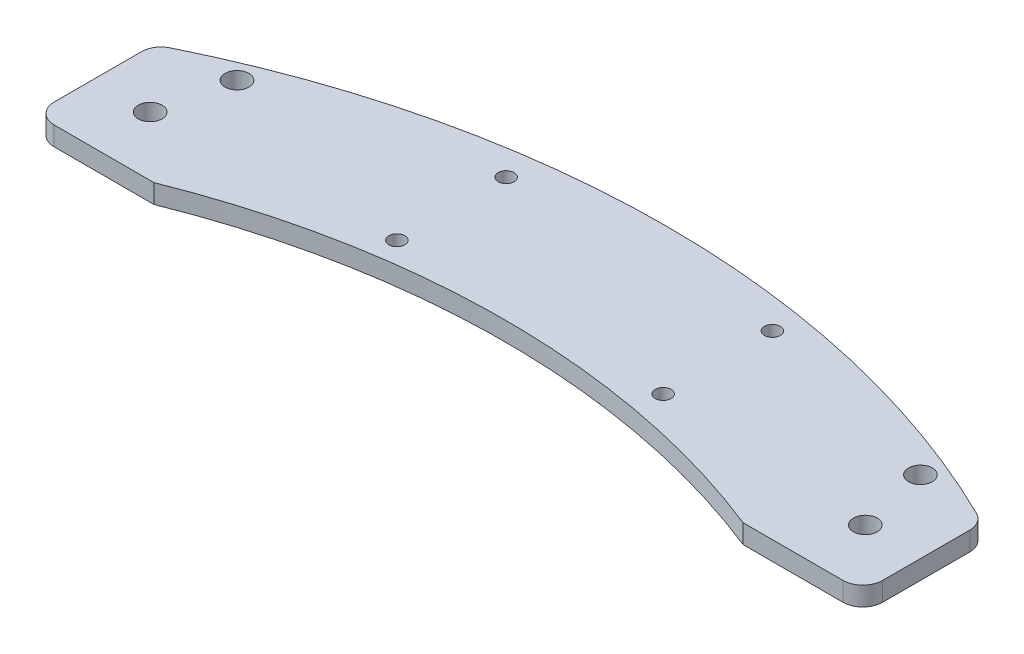
ISO-10303-21;
HEADER;
FILE_DESCRIPTION(('STEP AP214'),'2;1');
FILE_NAME('part.step','',(''),(''),'','','');
FILE_SCHEMA(('AUTOMOTIVE_DESIGN { 1 0 10303 214 1 1 1 1 }'));
ENDSEC;
DATA;
#1=APPLICATION_CONTEXT('core data for automotive mechanical design processes');
#2=APPLICATION_PROTOCOL_DEFINITION('international standard','automotive_design',2000,#1);
#3=PRODUCT_CONTEXT('',#1,'mechanical');
#4=PRODUCT('Part','Part','',(#3));
#5=PRODUCT_RELATED_PRODUCT_CATEGORY('part','',(#4));
#6=PRODUCT_DEFINITION_FORMATION('','',#4);
#7=PRODUCT_DEFINITION_CONTEXT('part definition',#1,'design');
#8=PRODUCT_DEFINITION('design','',#6,#7);
#9=PRODUCT_DEFINITION_SHAPE('','',#8);
#10=(LENGTH_UNIT() NAMED_UNIT(*) SI_UNIT(.MILLI.,.METRE.));
#11=(NAMED_UNIT(*) PLANE_ANGLE_UNIT() SI_UNIT($,.RADIAN.));
#12=(NAMED_UNIT(*) SI_UNIT($,.STERADIAN.) SOLID_ANGLE_UNIT());
#13=UNCERTAINTY_MEASURE_WITH_UNIT(LENGTH_MEASURE(1.E-05),#10,'distance_accuracy_value','');
#14=(GEOMETRIC_REPRESENTATION_CONTEXT(3) GLOBAL_UNCERTAINTY_ASSIGNED_CONTEXT((#13)) GLOBAL_UNIT_ASSIGNED_CONTEXT((#10,
#11,#12)) REPRESENTATION_CONTEXT('',''));
#15=CARTESIAN_POINT('',(0.,0.,0.));
#16=DIRECTION('',(0.,0.,1.));
#17=DIRECTION('',(1.,0.,0.));
#18=AXIS2_PLACEMENT_3D('',#15,#16,#17);
#19=CARTESIAN_POINT('',(0.,4.7752,0.));
#20=DIRECTION('',(0.,1.,0.));
#21=DIRECTION('',(0.,0.,1.));
#22=AXIS2_PLACEMENT_3D('',#19,#20,#21);
#23=PLANE('',#22);
#24=CARTESIAN_POINT('',(117.643252286146,4.7752,-0.323685487016556));
#25=DIRECTION('',(0.,1.,0.));
#26=DIRECTION('',(0.,0.,1.));
#27=AXIS2_PLACEMENT_3D('',#24,#25,#26);
#28=CIRCLE('',#27,3.00000000000001);
#29=CARTESIAN_POINT('',(117.643252286146,4.7752,2.67631451298345));
#30=VERTEX_POINT('',#29);
#31=EDGE_CURVE('E212',#30,#30,#28,.T.);
#32=ORIENTED_EDGE('',*,*,#31,.F.);
#33=EDGE_LOOP('',(#32));
#34=FACE_BOUND('',#33,.T.);
#35=CARTESIAN_POINT('',(0.643252286145771,4.7752,14.4263145129834));
#36=DIRECTION('',(0.,1.,0.));
#37=DIRECTION('',(0.,0.,1.));
#38=AXIS2_PLACEMENT_3D('',#35,#36,#37);
#39=CIRCLE('',#38,2.);
#40=CARTESIAN_POINT('',(0.643252286145771,4.7752,16.4263145129834));
#41=VERTEX_POINT('',#40);
#42=EDGE_CURVE('E224',#41,#41,#39,.T.);
#43=ORIENTED_EDGE('',*,*,#42,.F.);
#44=EDGE_LOOP('',(#43));
#45=FACE_BOUND('',#44,.T.);
#46=CARTESIAN_POINT('',(-54.3567477138542,4.7752,-0.323685487016556));
#47=DIRECTION('',(0.,1.,0.));
#48=DIRECTION('',(0.,0.,1.));
#49=AXIS2_PLACEMENT_3D('',#46,#47,#48);
#50=CIRCLE('',#49,3.);
#51=CARTESIAN_POINT('',(-54.3567477138542,4.7752,2.67631451298345));
#52=VERTEX_POINT('',#51);
#53=EDGE_CURVE('E236',#52,#52,#50,.T.);
#54=ORIENTED_EDGE('',*,*,#53,.F.);
#55=EDGE_LOOP('',(#54));
#56=FACE_BOUND('',#55,.T.);
#57=CARTESIAN_POINT('',(121.643252286146,4.7752,17.5263145129834));
#58=DIRECTION('',(0.,1.,0.));
#59=DIRECTION('',(0.,0.,1.));
#60=AXIS2_PLACEMENT_3D('',#57,#58,#59);
#61=CIRCLE('',#60,3.00000000000001);
#62=CARTESIAN_POINT('',(121.643252286146,4.7752,20.5263145129835));
#63=VERTEX_POINT('',#62);
#64=EDGE_CURVE('E148',#63,#63,#61,.T.);
#65=ORIENTED_EDGE('',*,*,#64,.F.);
#66=EDGE_LOOP('',(#65));
#67=FACE_BOUND('',#66,.T.);
#68=CARTESIAN_POINT('',(-58.3567477138542,4.7752,17.5263145129834));
#69=DIRECTION('',(0.,1.,0.));
#70=DIRECTION('',(0.,0.,1.));
#71=AXIS2_PLACEMENT_3D('',#68,#69,#70);
#72=CIRCLE('',#71,3.);
#73=CARTESIAN_POINT('',(-58.3567477138542,4.7752,20.5263145129834));
#74=VERTEX_POINT('',#73);
#75=EDGE_CURVE('E242',#74,#74,#72,.T.);
#76=ORIENTED_EDGE('',*,*,#75,.F.);
#77=EDGE_LOOP('',(#76));
#78=FACE_BOUND('',#77,.T.);
#79=CARTESIAN_POINT('',(67.6432522861458,4.7752,-13.0736854870166));
#80=DIRECTION('',(0.,1.,0.));
#81=DIRECTION('',(0.,0.,1.));
#82=AXIS2_PLACEMENT_3D('',#79,#80,#81);
#83=CIRCLE('',#82,2.);
#84=CARTESIAN_POINT('',(67.6432522861458,4.7752,-11.0736854870166));
#85=VERTEX_POINT('',#84);
#86=EDGE_CURVE('E230',#85,#85,#83,.T.);
#87=ORIENTED_EDGE('',*,*,#86,.F.);
#88=EDGE_LOOP('',(#87));
#89=FACE_BOUND('',#88,.T.);
#90=CARTESIAN_POINT('',(67.6432522861458,4.7752,14.4263145129834));
#91=DIRECTION('',(0.,1.,0.));
#92=DIRECTION('',(0.,0.,1.));
#93=AXIS2_PLACEMENT_3D('',#90,#91,#92);
#94=CIRCLE('',#93,2.);
#95=CARTESIAN_POINT('',(67.6432522861458,4.7752,16.4263145129834));
#96=VERTEX_POINT('',#95);
#97=EDGE_CURVE('E218',#96,#96,#94,.T.);
#98=ORIENTED_EDGE('',*,*,#97,.F.);
#99=EDGE_LOOP('',(#98));
#100=FACE_BOUND('',#99,.T.);
#101=CARTESIAN_POINT('',(0.643252286145771,4.7752,-13.0736854870166));
#102=DIRECTION('',(0.,1.,0.));
#103=DIRECTION('',(0.,0.,1.));
#104=AXIS2_PLACEMENT_3D('',#101,#102,#103);
#105=CIRCLE('',#104,2.);
#106=CARTESIAN_POINT('',(0.643252286145771,4.7752,-11.0736854870166));
#107=VERTEX_POINT('',#106);
#108=EDGE_CURVE('E206',#107,#107,#105,.T.);
#109=ORIENTED_EDGE('',*,*,#108,.F.);
#110=EDGE_LOOP('',(#109));
#111=FACE_BOUND('',#110,.T.);
#112=DIRECTION('',(1.,0.,0.));
#113=VECTOR('',#112,1.);
#114=CARTESIAN_POINT('',(-72.6067477138542,4.7752,32.4263145129834));
#115=LINE('',#114,#113);
#116=CARTESIAN_POINT('',(105.784586911306,4.7752,32.4263145129834));
#117=VERTEX_POINT('',#116);
#118=CARTESIAN_POINT('',(130.893252286146,4.7752,32.4263145129834));
#119=VERTEX_POINT('',#118);
#120=EDGE_CURVE('E129',#117,#119,#115,.T.);
#121=ORIENTED_EDGE('',*,*,#120,.T.);
#122=CARTESIAN_POINT('',(130.893252286146,4.7752,27.4263145129834));
#123=DIRECTION('',(0.,1.,0.));
#124=DIRECTION('',(0.,0.,1.));
#125=AXIS2_PLACEMENT_3D('',#122,#123,#124);
#126=CIRCLE('',#125,5.);
#127=CARTESIAN_POINT('',(135.893252286146,4.7752,27.4263145129834));
#128=VERTEX_POINT('',#127);
#129=EDGE_CURVE('E173',#119,#128,#126,.T.);
#130=ORIENTED_EDGE('',*,*,#129,.T.);
#131=DIRECTION('',(0.,0.,-1.));
#132=VECTOR('',#131,1.);
#133=CARTESIAN_POINT('',(135.893252286146,4.7752,-22.5736854870166));
#134=LINE('',#133,#132);
#135=CARTESIAN_POINT('',(135.893252286146,4.7752,5.49950227647036));
#136=VERTEX_POINT('',#135);
#137=EDGE_CURVE('E126',#128,#136,#134,.T.);
#138=ORIENTED_EDGE('',*,*,#137,.T.);
#139=CARTESIAN_POINT('',(130.893252286146,4.7752,5.49950227647036));
#140=DIRECTION('',(0.,1.,0.));
#141=DIRECTION('',(0.,0.,1.));
#142=AXIS2_PLACEMENT_3D('',#139,#140,#141);
#143=CIRCLE('',#142,5.);
#144=CARTESIAN_POINT('',(133.098807841701,4.7752,1.01223978232562));
#145=VERTEX_POINT('',#144);
#146=EDGE_CURVE('E171',#136,#145,#143,.T.);
#147=ORIENTED_EDGE('',*,*,#146,.T.);
#148=CARTESIAN_POINT('',(31.6432522861458,4.7752,207.426314512983));
#149=DIRECTION('',(0.,1.,0.));
#150=DIRECTION('',(0.,0.,1.));
#151=AXIS2_PLACEMENT_3D('',#148,#149,#150);
#152=CIRCLE('',#151,230.);
#153=CARTESIAN_POINT('',(-69.8123032694098,4.7752,1.01223978232565));
#154=VERTEX_POINT('',#153);
#155=EDGE_CURVE('E198',#145,#154,#152,.T.);
#156=ORIENTED_EDGE('',*,*,#155,.T.);
#157=CARTESIAN_POINT('',(-67.6067477138542,4.7752,5.49950227647036));
#158=DIRECTION('',(0.,1.,0.));
#159=DIRECTION('',(0.,0.,1.));
#160=AXIS2_PLACEMENT_3D('',#157,#158,#159);
#161=CIRCLE('',#160,5.);
#162=CARTESIAN_POINT('',(-72.6067477138542,4.7752,5.49950227647036));
#163=VERTEX_POINT('',#162);
#164=EDGE_CURVE('E169',#154,#163,#161,.T.);
#165=ORIENTED_EDGE('',*,*,#164,.T.);
#166=DIRECTION('',(0.,0.,1.));
#167=VECTOR('',#166,1.);
#168=CARTESIAN_POINT('',(-72.6067477138542,4.7752,-22.5736854870166));
#169=LINE('',#168,#167);
#170=CARTESIAN_POINT('',(-72.6067477138542,4.7752,27.4263145129834));
#171=VERTEX_POINT('',#170);
#172=EDGE_CURVE('E137',#163,#171,#169,.T.);
#173=ORIENTED_EDGE('',*,*,#172,.T.);
#174=CARTESIAN_POINT('',(-67.6067477138542,4.7752,27.4263145129834));
#175=DIRECTION('',(0.,1.,0.));
#176=DIRECTION('',(0.,0.,1.));
#177=AXIS2_PLACEMENT_3D('',#174,#175,#176);
#178=CIRCLE('',#177,5.);
#179=CARTESIAN_POINT('',(-67.6067477138542,4.7752,32.4263145129834));
#180=VERTEX_POINT('',#179);
#181=EDGE_CURVE('E49',#171,#180,#178,.T.);
#182=ORIENTED_EDGE('',*,*,#181,.T.);
#183=CARTESIAN_POINT('',(-42.4980823390147,4.7752,32.4263145129834));
#184=VERTEX_POINT('',#183);
#185=EDGE_CURVE('E131',#180,#184,#115,.T.);
#186=ORIENTED_EDGE('',*,*,#185,.T.);
#187=CARTESIAN_POINT('',(31.6432522861458,4.7752,218.176314512983));
#188=DIRECTION('',(0.,1.,0.));
#189=DIRECTION('',(0.,0.,1.));
#190=AXIS2_PLACEMENT_3D('',#187,#188,#189);
#191=CIRCLE('',#190,200.);
#192=EDGE_CURVE('E117',#117,#184,#191,.T.);
#193=ORIENTED_EDGE('',*,*,#192,.F.);
#194=EDGE_LOOP('',(#121,#130,#138,#147,#156,#165,#173,#182,#186,#193));
#195=FACE_BOUND('',#194,.T.);
#196=ADVANCED_FACE('F34',(#34,#45,#56,#67,#78,#89,#100,#111,#195),#23,.T.);
#197=CARTESIAN_POINT('',(0.,0.,0.));
#198=DIRECTION('',(0.,1.,0.));
#199=DIRECTION('',(0.,0.,1.));
#200=AXIS2_PLACEMENT_3D('',#197,#198,#199);
#201=PLANE('',#200);
#202=CARTESIAN_POINT('',(117.643252286146,0.,-0.323685487016556));
#203=DIRECTION('',(0.,1.,0.));
#204=DIRECTION('',(0.,0.,1.));
#205=AXIS2_PLACEMENT_3D('',#202,#203,#204);
#206=CIRCLE('',#205,3.00000000000001);
#207=CARTESIAN_POINT('',(117.643252286146,0.,2.67631451298345));
#208=VERTEX_POINT('',#207);
#209=EDGE_CURVE('E209',#208,#208,#206,.T.);
#210=ORIENTED_EDGE('',*,*,#209,.T.);
#211=EDGE_LOOP('',(#210));
#212=FACE_BOUND('',#211,.T.);
#213=CARTESIAN_POINT('',(0.643252286145771,0.,14.4263145129834));
#214=DIRECTION('',(0.,1.,0.));
#215=DIRECTION('',(0.,0.,1.));
#216=AXIS2_PLACEMENT_3D('',#213,#214,#215);
#217=CIRCLE('',#216,2.);
#218=CARTESIAN_POINT('',(0.643252286145771,0.,16.4263145129834));
#219=VERTEX_POINT('',#218);
#220=EDGE_CURVE('E221',#219,#219,#217,.T.);
#221=ORIENTED_EDGE('',*,*,#220,.T.);
#222=EDGE_LOOP('',(#221));
#223=FACE_BOUND('',#222,.T.);
#224=CARTESIAN_POINT('',(-54.3567477138542,0.,-0.323685487016556));
#225=DIRECTION('',(0.,1.,0.));
#226=DIRECTION('',(0.,0.,1.));
#227=AXIS2_PLACEMENT_3D('',#224,#225,#226);
#228=CIRCLE('',#227,3.);
#229=CARTESIAN_POINT('',(-54.3567477138542,0.,2.67631451298345));
#230=VERTEX_POINT('',#229);
#231=EDGE_CURVE('E233',#230,#230,#228,.T.);
#232=ORIENTED_EDGE('',*,*,#231,.T.);
#233=EDGE_LOOP('',(#232));
#234=FACE_BOUND('',#233,.T.);
#235=CARTESIAN_POINT('',(121.643252286146,0.,17.5263145129834));
#236=DIRECTION('',(0.,1.,0.));
#237=DIRECTION('',(0.,0.,1.));
#238=AXIS2_PLACEMENT_3D('',#235,#236,#237);
#239=CIRCLE('',#238,3.00000000000001);
#240=CARTESIAN_POINT('',(121.643252286146,0.,20.5263145129835));
#241=VERTEX_POINT('',#240);
#242=EDGE_CURVE('E245',#241,#241,#239,.T.);
#243=ORIENTED_EDGE('',*,*,#242,.T.);
#244=EDGE_LOOP('',(#243));
#245=FACE_BOUND('',#244,.T.);
#246=CARTESIAN_POINT('',(-58.3567477138542,0.,17.5263145129834));
#247=DIRECTION('',(0.,1.,0.));
#248=DIRECTION('',(0.,0.,1.));
#249=AXIS2_PLACEMENT_3D('',#246,#247,#248);
#250=CIRCLE('',#249,3.);
#251=CARTESIAN_POINT('',(-58.3567477138542,0.,20.5263145129834));
#252=VERTEX_POINT('',#251);
#253=EDGE_CURVE('E239',#252,#252,#250,.T.);
#254=ORIENTED_EDGE('',*,*,#253,.T.);
#255=EDGE_LOOP('',(#254));
#256=FACE_BOUND('',#255,.T.);
#257=CARTESIAN_POINT('',(67.6432522861458,0.,-13.0736854870166));
#258=DIRECTION('',(0.,1.,0.));
#259=DIRECTION('',(0.,0.,1.));
#260=AXIS2_PLACEMENT_3D('',#257,#258,#259);
#261=CIRCLE('',#260,2.);
#262=CARTESIAN_POINT('',(67.6432522861458,0.,-11.0736854870166));
#263=VERTEX_POINT('',#262);
#264=EDGE_CURVE('E227',#263,#263,#261,.T.);
#265=ORIENTED_EDGE('',*,*,#264,.T.);
#266=EDGE_LOOP('',(#265));
#267=FACE_BOUND('',#266,.T.);
#268=CARTESIAN_POINT('',(67.6432522861458,0.,14.4263145129834));
#269=DIRECTION('',(0.,1.,0.));
#270=DIRECTION('',(0.,0.,1.));
#271=AXIS2_PLACEMENT_3D('',#268,#269,#270);
#272=CIRCLE('',#271,2.);
#273=CARTESIAN_POINT('',(67.6432522861458,0.,16.4263145129834));
#274=VERTEX_POINT('',#273);
#275=EDGE_CURVE('E215',#274,#274,#272,.T.);
#276=ORIENTED_EDGE('',*,*,#275,.T.);
#277=EDGE_LOOP('',(#276));
#278=FACE_BOUND('',#277,.T.);
#279=CARTESIAN_POINT('',(0.643252286145771,0.,-13.0736854870166));
#280=DIRECTION('',(0.,1.,0.));
#281=DIRECTION('',(0.,0.,1.));
#282=AXIS2_PLACEMENT_3D('',#279,#280,#281);
#283=CIRCLE('',#282,2.);
#284=CARTESIAN_POINT('',(0.643252286145771,0.,-11.0736854870166));
#285=VERTEX_POINT('',#284);
#286=EDGE_CURVE('E204',#285,#285,#283,.T.);
#287=ORIENTED_EDGE('',*,*,#286,.T.);
#288=EDGE_LOOP('',(#287));
#289=FACE_BOUND('',#288,.T.);
#290=DIRECTION('',(0.,0.,-1.));
#291=VECTOR('',#290,1.);
#292=CARTESIAN_POINT('',(135.893252286146,0.,-22.5736854870166));
#293=LINE('',#292,#291);
#294=CARTESIAN_POINT('',(135.893252286146,0.,27.4263145129834));
#295=VERTEX_POINT('',#294);
#296=CARTESIAN_POINT('',(135.893252286146,0.,5.49950227647036));
#297=VERTEX_POINT('',#296);
#298=EDGE_CURVE('E139',#295,#297,#293,.T.);
#299=ORIENTED_EDGE('',*,*,#298,.F.);
#300=CARTESIAN_POINT('',(130.893252286146,0.,27.4263145129834));
#301=DIRECTION('',(0.,1.,0.));
#302=DIRECTION('',(0.,0.,1.));
#303=AXIS2_PLACEMENT_3D('',#300,#301,#302);
#304=CIRCLE('',#303,5.);
#305=CARTESIAN_POINT('',(130.893252286146,0.,32.4263145129834));
#306=VERTEX_POINT('',#305);
#307=EDGE_CURVE('E165',#295,#306,#304,.F.);
#308=ORIENTED_EDGE('',*,*,#307,.T.);
#309=DIRECTION('',(1.,0.,0.));
#310=VECTOR('',#309,1.);
#311=CARTESIAN_POINT('',(-72.6067477138542,0.,32.4263145129834));
#312=LINE('',#311,#310);
#313=CARTESIAN_POINT('',(105.784586911306,0.,32.4263145129834));
#314=VERTEX_POINT('',#313);
#315=EDGE_CURVE('E147',#314,#306,#312,.T.);
#316=ORIENTED_EDGE('',*,*,#315,.F.);
#317=CARTESIAN_POINT('',(31.6432522861458,0.,218.176314512983));
#318=DIRECTION('',(0.,1.,0.));
#319=DIRECTION('',(0.,0.,1.));
#320=AXIS2_PLACEMENT_3D('',#317,#318,#319);
#321=CIRCLE('',#320,200.);
#322=CARTESIAN_POINT('',(-42.4980823390147,0.,32.4263145129834));
#323=VERTEX_POINT('',#322);
#324=EDGE_CURVE('E120',#314,#323,#321,.T.);
#325=ORIENTED_EDGE('',*,*,#324,.T.);
#326=CARTESIAN_POINT('',(-67.6067477138542,0.,32.4263145129834));
#327=VERTEX_POINT('',#326);
#328=EDGE_CURVE('E149',#327,#323,#312,.T.);
#329=ORIENTED_EDGE('',*,*,#328,.F.);
#330=CARTESIAN_POINT('',(-67.6067477138542,0.,27.4263145129834));
#331=DIRECTION('',(0.,1.,0.));
#332=DIRECTION('',(0.,0.,1.));
#333=AXIS2_PLACEMENT_3D('',#330,#331,#332);
#334=CIRCLE('',#333,5.);
#335=CARTESIAN_POINT('',(-72.6067477138542,0.,27.4263145129834));
#336=VERTEX_POINT('',#335);
#337=EDGE_CURVE('E159',#327,#336,#334,.F.);
#338=ORIENTED_EDGE('',*,*,#337,.T.);
#339=DIRECTION('',(0.,0.,1.));
#340=VECTOR('',#339,1.);
#341=CARTESIAN_POINT('',(-72.6067477138542,0.,-22.5736854870166));
#342=LINE('',#341,#340);
#343=CARTESIAN_POINT('',(-72.6067477138542,0.,5.49950227647036));
#344=VERTEX_POINT('',#343);
#345=EDGE_CURVE('E145',#344,#336,#342,.T.);
#346=ORIENTED_EDGE('',*,*,#345,.F.);
#347=CARTESIAN_POINT('',(-67.6067477138542,0.,5.49950227647036));
#348=DIRECTION('',(0.,1.,0.));
#349=DIRECTION('',(0.,0.,1.));
#350=AXIS2_PLACEMENT_3D('',#347,#348,#349);
#351=CIRCLE('',#350,5.);
#352=CARTESIAN_POINT('',(-69.8123032694098,0.,1.01223978232565));
#353=VERTEX_POINT('',#352);
#354=EDGE_CURVE('E161',#344,#353,#351,.F.);
#355=ORIENTED_EDGE('',*,*,#354,.T.);
#356=CARTESIAN_POINT('',(31.6432522861458,0.,207.426314512983));
#357=DIRECTION('',(0.,1.,0.));
#358=DIRECTION('',(0.,0.,1.));
#359=AXIS2_PLACEMENT_3D('',#356,#357,#358);
#360=CIRCLE('',#359,230.);
#361=CARTESIAN_POINT('',(133.098807841701,0.,1.01223978232562));
#362=VERTEX_POINT('',#361);
#363=EDGE_CURVE('E132',#362,#353,#360,.T.);
#364=ORIENTED_EDGE('',*,*,#363,.F.);
#365=CARTESIAN_POINT('',(130.893252286146,0.,5.49950227647036));
#366=DIRECTION('',(0.,1.,0.));
#367=DIRECTION('',(0.,0.,1.));
#368=AXIS2_PLACEMENT_3D('',#365,#366,#367);
#369=CIRCLE('',#368,5.);
#370=EDGE_CURVE('E163',#362,#297,#369,.F.);
#371=ORIENTED_EDGE('',*,*,#370,.T.);
#372=EDGE_LOOP('',(#299,#308,#316,#325,#329,#338,#346,#355,#364,#371));
#373=FACE_BOUND('',#372,.T.);
#374=ADVANCED_FACE('F188',(#212,#223,#234,#245,#256,#267,#278,#289,#373),#201,.F.);
#375=CARTESIAN_POINT('',(-72.6067477138542,4.7752,-22.5736854870166));
#376=DIRECTION('',(1.,0.,0.));
#377=DIRECTION('',(0.,0.,-1.));
#378=AXIS2_PLACEMENT_3D('',#375,#376,#377);
#379=PLANE('',#378);
#380=ORIENTED_EDGE('',*,*,#172,.F.);
#381=DIRECTION('',(0.,-1.,0.));
#382=VECTOR('',#381,1.);
#383=CARTESIAN_POINT('',(-72.6067477138542,0.,5.49950227647036));
#384=LINE('',#383,#382);
#385=EDGE_CURVE('E42',#163,#344,#384,.T.);
#386=ORIENTED_EDGE('',*,*,#385,.T.);
#387=ORIENTED_EDGE('',*,*,#345,.T.);
#388=DIRECTION('',(0.,-1.,0.));
#389=VECTOR('',#388,1.);
#390=CARTESIAN_POINT('',(-72.6067477138542,4.7752,27.4263145129834));
#391=LINE('',#390,#389);
#392=EDGE_CURVE('E57',#336,#171,#391,.F.);
#393=ORIENTED_EDGE('',*,*,#392,.T.);
#394=EDGE_LOOP('',(#380,#386,#387,#393));
#395=FACE_BOUND('',#394,.T.);
#396=ADVANCED_FACE('F183',(#395),#379,.F.);
#397=CARTESIAN_POINT('',(135.893252286146,4.7752,-22.5736854870166));
#398=DIRECTION('',(-1.,0.,0.));
#399=DIRECTION('',(0.,0.,1.));
#400=AXIS2_PLACEMENT_3D('',#397,#398,#399);
#401=PLANE('',#400);
#402=ORIENTED_EDGE('',*,*,#137,.F.);
#403=DIRECTION('',(0.,-1.,0.));
#404=VECTOR('',#403,1.);
#405=CARTESIAN_POINT('',(135.893252286146,4.7752,27.4263145129834));
#406=LINE('',#405,#404);
#407=EDGE_CURVE('E156',#128,#295,#406,.T.);
#408=ORIENTED_EDGE('',*,*,#407,.T.);
#409=ORIENTED_EDGE('',*,*,#298,.T.);
#410=DIRECTION('',(0.,-1.,0.));
#411=VECTOR('',#410,1.);
#412=CARTESIAN_POINT('',(135.893252286146,4.7752,5.49950227647036));
#413=LINE('',#412,#411);
#414=EDGE_CURVE('E154',#297,#136,#413,.F.);
#415=ORIENTED_EDGE('',*,*,#414,.T.);
#416=EDGE_LOOP('',(#402,#408,#409,#415));
#417=FACE_BOUND('',#416,.T.);
#418=ADVANCED_FACE('F281',(#417),#401,.F.);
#419=CARTESIAN_POINT('',(-72.6067477138542,4.7752,32.4263145129834));
#420=DIRECTION('',(0.,0.,-1.));
#421=DIRECTION('',(-1.,0.,0.));
#422=AXIS2_PLACEMENT_3D('',#419,#420,#421);
#423=PLANE('',#422);
#424=ORIENTED_EDGE('',*,*,#185,.F.);
#425=DIRECTION('',(0.,-1.,0.));
#426=VECTOR('',#425,1.);
#427=CARTESIAN_POINT('',(-67.6067477138542,4.7752,32.4263145129834));
#428=LINE('',#427,#426);
#429=EDGE_CURVE('E12',#180,#327,#428,.T.);
#430=ORIENTED_EDGE('',*,*,#429,.T.);
#431=ORIENTED_EDGE('',*,*,#328,.T.);
#432=DIRECTION('',(0.,1.,0.));
#433=VECTOR('',#432,1.);
#434=CARTESIAN_POINT('',(-42.4980823390147,0.,32.4263145129834));
#435=LINE('',#434,#433);
#436=EDGE_CURVE('E125',#323,#184,#435,.T.);
#437=ORIENTED_EDGE('',*,*,#436,.T.);
#438=EDGE_LOOP('',(#424,#430,#431,#437));
#439=FACE_BOUND('',#438,.T.);
#440=ADVANCED_FACE('F267',(#439),#423,.F.);
#441=ORIENTED_EDGE('',*,*,#315,.T.);
#442=DIRECTION('',(0.,-1.,0.));
#443=VECTOR('',#442,1.);
#444=CARTESIAN_POINT('',(130.893252286146,4.7752,32.4263145129834));
#445=LINE('',#444,#443);
#446=EDGE_CURVE('E136',#306,#119,#445,.F.);
#447=ORIENTED_EDGE('',*,*,#446,.T.);
#448=ORIENTED_EDGE('',*,*,#120,.F.);
#449=DIRECTION('',(0.,1.,0.));
#450=VECTOR('',#449,1.);
#451=CARTESIAN_POINT('',(105.784586911306,0.,32.4263145129834));
#452=LINE('',#451,#450);
#453=EDGE_CURVE('E113',#117,#314,#452,.F.);
#454=ORIENTED_EDGE('',*,*,#453,.T.);
#455=EDGE_LOOP('',(#441,#447,#448,#454));
#456=FACE_BOUND('',#455,.T.);
#457=ADVANCED_FACE('F134',(#456),#423,.F.);
#458=CARTESIAN_POINT('',(121.643252286146,4.7752,17.5263145129834));
#459=DIRECTION('',(0.,-1.,0.));
#460=DIRECTION('',(0.,0.,-1.));
#461=AXIS2_PLACEMENT_3D('',#458,#459,#460);
#462=CYLINDRICAL_SURFACE('',#461,3.00000000000001);
#463=ORIENTED_EDGE('',*,*,#64,.T.);
#464=EDGE_LOOP('',(#463));
#465=FACE_BOUND('',#464,.T.);
#466=ORIENTED_EDGE('',*,*,#242,.F.);
#467=EDGE_LOOP('',(#466));
#468=FACE_BOUND('',#467,.T.);
#469=ADVANCED_FACE('F254',(#465,#468),#462,.F.);
#470=CARTESIAN_POINT('',(-58.3567477138542,4.7752,17.5263145129834));
#471=DIRECTION('',(0.,-1.,0.));
#472=DIRECTION('',(0.,0.,-1.));
#473=AXIS2_PLACEMENT_3D('',#470,#471,#472);
#474=CYLINDRICAL_SURFACE('',#473,3.);
#475=ORIENTED_EDGE('',*,*,#75,.T.);
#476=EDGE_LOOP('',(#475));
#477=FACE_BOUND('',#476,.T.);
#478=ORIENTED_EDGE('',*,*,#253,.F.);
#479=EDGE_LOOP('',(#478));
#480=FACE_BOUND('',#479,.T.);
#481=ADVANCED_FACE('F256',(#477,#480),#474,.F.);
#482=CARTESIAN_POINT('',(-54.3567477138542,4.7752,-0.323685487016556));
#483=DIRECTION('',(0.,-1.,0.));
#484=DIRECTION('',(0.,0.,-1.));
#485=AXIS2_PLACEMENT_3D('',#482,#483,#484);
#486=CYLINDRICAL_SURFACE('',#485,3.);
#487=ORIENTED_EDGE('',*,*,#53,.T.);
#488=EDGE_LOOP('',(#487));
#489=FACE_BOUND('',#488,.T.);
#490=ORIENTED_EDGE('',*,*,#231,.F.);
#491=EDGE_LOOP('',(#490));
#492=FACE_BOUND('',#491,.T.);
#493=ADVANCED_FACE('F263',(#489,#492),#486,.F.);
#494=CARTESIAN_POINT('',(67.6432522861458,4.7752,-13.0736854870166));
#495=DIRECTION('',(0.,-1.,0.));
#496=DIRECTION('',(0.,0.,-1.));
#497=AXIS2_PLACEMENT_3D('',#494,#495,#496);
#498=CYLINDRICAL_SURFACE('',#497,2.);
#499=ORIENTED_EDGE('',*,*,#86,.T.);
#500=EDGE_LOOP('',(#499));
#501=FACE_BOUND('',#500,.T.);
#502=ORIENTED_EDGE('',*,*,#264,.F.);
#503=EDGE_LOOP('',(#502));
#504=FACE_BOUND('',#503,.T.);
#505=ADVANCED_FACE('F397',(#501,#504),#498,.F.);
#506=CARTESIAN_POINT('',(0.643252286145771,4.7752,14.4263145129834));
#507=DIRECTION('',(0.,-1.,0.));
#508=DIRECTION('',(0.,0.,-1.));
#509=AXIS2_PLACEMENT_3D('',#506,#507,#508);
#510=CYLINDRICAL_SURFACE('',#509,2.);
#511=ORIENTED_EDGE('',*,*,#42,.T.);
#512=EDGE_LOOP('',(#511));
#513=FACE_BOUND('',#512,.T.);
#514=ORIENTED_EDGE('',*,*,#220,.F.);
#515=EDGE_LOOP('',(#514));
#516=FACE_BOUND('',#515,.T.);
#517=ADVANCED_FACE('F389',(#513,#516),#510,.F.);
#518=CARTESIAN_POINT('',(67.6432522861458,4.7752,14.4263145129834));
#519=DIRECTION('',(0.,-1.,0.));
#520=DIRECTION('',(0.,0.,-1.));
#521=AXIS2_PLACEMENT_3D('',#518,#519,#520);
#522=CYLINDRICAL_SURFACE('',#521,2.);
#523=ORIENTED_EDGE('',*,*,#97,.T.);
#524=EDGE_LOOP('',(#523));
#525=FACE_BOUND('',#524,.T.);
#526=ORIENTED_EDGE('',*,*,#275,.F.);
#527=EDGE_LOOP('',(#526));
#528=FACE_BOUND('',#527,.T.);
#529=ADVANCED_FACE('F381',(#525,#528),#522,.F.);
#530=CARTESIAN_POINT('',(117.643252286146,4.7752,-0.323685487016556));
#531=DIRECTION('',(0.,-1.,0.));
#532=DIRECTION('',(0.,0.,-1.));
#533=AXIS2_PLACEMENT_3D('',#530,#531,#532);
#534=CYLINDRICAL_SURFACE('',#533,3.00000000000001);
#535=ORIENTED_EDGE('',*,*,#31,.T.);
#536=EDGE_LOOP('',(#535));
#537=FACE_BOUND('',#536,.T.);
#538=ORIENTED_EDGE('',*,*,#209,.F.);
#539=EDGE_LOOP('',(#538));
#540=FACE_BOUND('',#539,.T.);
#541=ADVANCED_FACE('F373',(#537,#540),#534,.F.);
#542=CARTESIAN_POINT('',(0.643252286145771,4.7752,-13.0736854870166));
#543=DIRECTION('',(0.,-1.,0.));
#544=DIRECTION('',(0.,0.,-1.));
#545=AXIS2_PLACEMENT_3D('',#542,#543,#544);
#546=CYLINDRICAL_SURFACE('',#545,2.);
#547=ORIENTED_EDGE('',*,*,#108,.T.);
#548=EDGE_LOOP('',(#547));
#549=FACE_BOUND('',#548,.T.);
#550=ORIENTED_EDGE('',*,*,#286,.F.);
#551=EDGE_LOOP('',(#550));
#552=FACE_BOUND('',#551,.T.);
#553=ADVANCED_FACE('F367',(#549,#552),#546,.F.);
#554=CARTESIAN_POINT('',(31.6432522861458,0.,218.176314512983));
#555=DIRECTION('',(0.,1.,0.));
#556=DIRECTION('',(0.,0.,1.));
#557=AXIS2_PLACEMENT_3D('',#554,#555,#556);
#558=CYLINDRICAL_SURFACE('',#557,200.);
#559=ORIENTED_EDGE('',*,*,#324,.F.);
#560=ORIENTED_EDGE('',*,*,#453,.F.);
#561=ORIENTED_EDGE('',*,*,#192,.T.);
#562=ORIENTED_EDGE('',*,*,#436,.F.);
#563=EDGE_LOOP('',(#559,#560,#561,#562));
#564=FACE_BOUND('',#563,.T.);
#565=ADVANCED_FACE('F115',(#564),#558,.F.);
#566=CARTESIAN_POINT('',(31.6432522861458,0.,207.426314512983));
#567=DIRECTION('',(0.,1.,0.));
#568=DIRECTION('',(0.,0.,1.));
#569=AXIS2_PLACEMENT_3D('',#566,#567,#568);
#570=CYLINDRICAL_SURFACE('',#569,230.);
#571=ORIENTED_EDGE('',*,*,#155,.F.);
#572=DIRECTION('',(0.,1.,0.));
#573=VECTOR('',#572,1.);
#574=CARTESIAN_POINT('',(133.098807841701,0.,1.01223978232562));
#575=LINE('',#574,#573);
#576=EDGE_CURVE('E178',#145,#362,#575,.F.);
#577=ORIENTED_EDGE('',*,*,#576,.T.);
#578=ORIENTED_EDGE('',*,*,#363,.T.);
#579=DIRECTION('',(0.,1.,0.));
#580=VECTOR('',#579,1.);
#581=CARTESIAN_POINT('',(-69.8123032694098,0.,1.01223978232559));
#582=LINE('',#581,#580);
#583=EDGE_CURVE('E175',#353,#154,#582,.T.);
#584=ORIENTED_EDGE('',*,*,#583,.T.);
#585=EDGE_LOOP('',(#571,#577,#578,#584));
#586=FACE_BOUND('',#585,.T.);
#587=ADVANCED_FACE('F197',(#586),#570,.T.);
#588=CARTESIAN_POINT('',(130.893252286146,4.7752,27.4263145129834));
#589=DIRECTION('',(0.,-1.,0.));
#590=DIRECTION('',(0.,0.,-1.));
#591=AXIS2_PLACEMENT_3D('',#588,#589,#590);
#592=CYLINDRICAL_SURFACE('',#591,5.);
#593=ORIENTED_EDGE('',*,*,#129,.F.);
#594=ORIENTED_EDGE('',*,*,#446,.F.);
#595=ORIENTED_EDGE('',*,*,#307,.F.);
#596=ORIENTED_EDGE('',*,*,#407,.F.);
#597=EDGE_LOOP('',(#593,#594,#595,#596));
#598=FACE_BOUND('',#597,.T.);
#599=ADVANCED_FACE('F287',(#598),#592,.T.);
#600=CARTESIAN_POINT('',(130.893252286146,0.,5.49950227647036));
#601=DIRECTION('',(0.,1.,0.));
#602=DIRECTION('',(0.,0.,1.));
#603=AXIS2_PLACEMENT_3D('',#600,#601,#602);
#604=CYLINDRICAL_SURFACE('',#603,5.);
#605=ORIENTED_EDGE('',*,*,#146,.F.);
#606=ORIENTED_EDGE('',*,*,#414,.F.);
#607=ORIENTED_EDGE('',*,*,#370,.F.);
#608=ORIENTED_EDGE('',*,*,#576,.F.);
#609=EDGE_LOOP('',(#605,#606,#607,#608));
#610=FACE_BOUND('',#609,.T.);
#611=ADVANCED_FACE('F290',(#610),#604,.T.);
#612=CARTESIAN_POINT('',(-67.6067477138542,0.,5.49950227647036));
#613=DIRECTION('',(0.,1.,0.));
#614=DIRECTION('',(0.,0.,1.));
#615=AXIS2_PLACEMENT_3D('',#612,#613,#614);
#616=CYLINDRICAL_SURFACE('',#615,5.);
#617=ORIENTED_EDGE('',*,*,#354,.F.);
#618=ORIENTED_EDGE('',*,*,#385,.F.);
#619=ORIENTED_EDGE('',*,*,#164,.F.);
#620=ORIENTED_EDGE('',*,*,#583,.F.);
#621=EDGE_LOOP('',(#617,#618,#619,#620));
#622=FACE_BOUND('',#621,.T.);
#623=ADVANCED_FACE('F193',(#622),#616,.T.);
#624=CARTESIAN_POINT('',(-67.6067477138542,4.7752,27.4263145129834));
#625=DIRECTION('',(0.,-1.,0.));
#626=DIRECTION('',(0.,0.,-1.));
#627=AXIS2_PLACEMENT_3D('',#624,#625,#626);
#628=CYLINDRICAL_SURFACE('',#627,5.);
#629=ORIENTED_EDGE('',*,*,#181,.F.);
#630=ORIENTED_EDGE('',*,*,#392,.F.);
#631=ORIENTED_EDGE('',*,*,#337,.F.);
#632=ORIENTED_EDGE('',*,*,#429,.F.);
#633=EDGE_LOOP('',(#629,#630,#631,#632));
#634=FACE_BOUND('',#633,.T.);
#635=ADVANCED_FACE('F36',(#634),#628,.T.);
#636=CLOSED_SHELL('',(#196,#374,#396,#418,#440,#457,#469,#481,#493,#505,#517,#529,#541,#553,
#565,#587,#599,#611,#623,#635));
#637=MANIFOLD_SOLID_BREP('B2',#636);
#638=ADVANCED_BREP_SHAPE_REPRESENTATION('',(#18,#637),#14);
#639=SHAPE_DEFINITION_REPRESENTATION(#9,#638);
ENDSEC;
END-ISO-10303-21;
